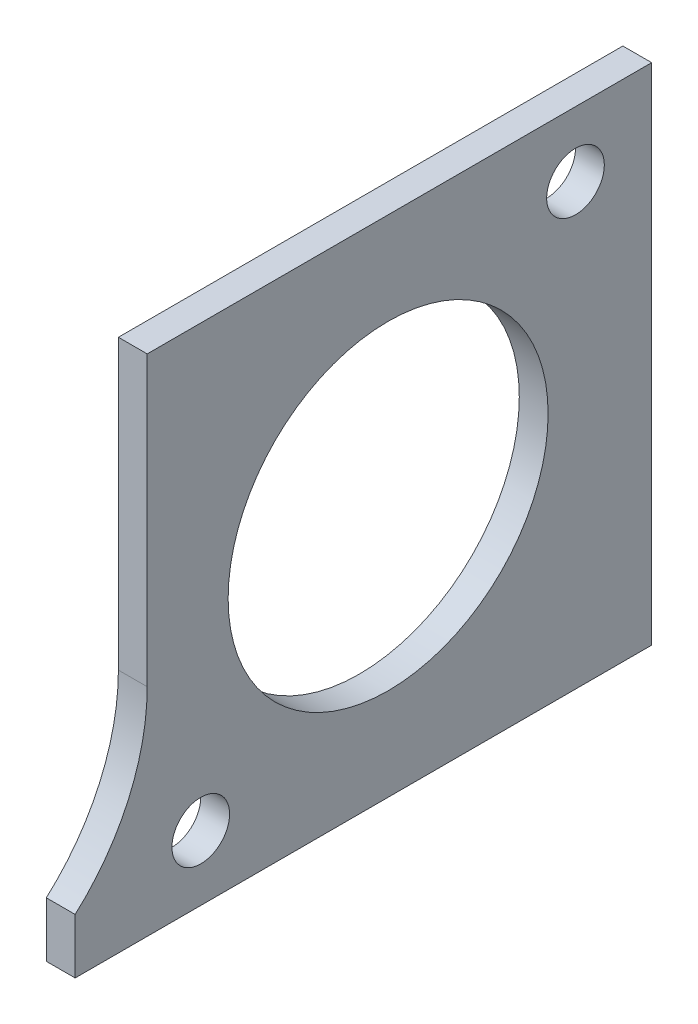
ISO-10303-21;
HEADER;
FILE_DESCRIPTION(('STEP AP214'),'2;1');
FILE_NAME('part.step','',(''),(''),'','','');
FILE_SCHEMA(('AUTOMOTIVE_DESIGN { 1 0 10303 214 1 1 1 1 }'));
ENDSEC;
DATA;
#1=APPLICATION_CONTEXT('core data for automotive mechanical design processes');
#2=APPLICATION_PROTOCOL_DEFINITION('international standard','automotive_design',2000,#1);
#3=PRODUCT_CONTEXT('',#1,'mechanical');
#4=PRODUCT('Part','Part','',(#3));
#5=PRODUCT_RELATED_PRODUCT_CATEGORY('part','',(#4));
#6=PRODUCT_DEFINITION_FORMATION('','',#4);
#7=PRODUCT_DEFINITION_CONTEXT('part definition',#1,'design');
#8=PRODUCT_DEFINITION('design','',#6,#7);
#9=PRODUCT_DEFINITION_SHAPE('','',#8);
#10=(LENGTH_UNIT() NAMED_UNIT(*) SI_UNIT(.MILLI.,.METRE.));
#11=(NAMED_UNIT(*) PLANE_ANGLE_UNIT() SI_UNIT($,.RADIAN.));
#12=(NAMED_UNIT(*) SI_UNIT($,.STERADIAN.) SOLID_ANGLE_UNIT());
#13=UNCERTAINTY_MEASURE_WITH_UNIT(LENGTH_MEASURE(1.E-05),#10,'distance_accuracy_value','');
#14=(GEOMETRIC_REPRESENTATION_CONTEXT(3) GLOBAL_UNCERTAINTY_ASSIGNED_CONTEXT((#13)) GLOBAL_UNIT_ASSIGNED_CONTEXT((#10,
#11,#12)) REPRESENTATION_CONTEXT('',''));
#15=CARTESIAN_POINT('',(0.,0.,0.));
#16=DIRECTION('',(0.,0.,1.));
#17=DIRECTION('',(1.,0.,0.));
#18=AXIS2_PLACEMENT_3D('',#15,#16,#17);
#19=CARTESIAN_POINT('',(2.,-9.34311908078087,35.0215806294578));
#20=DIRECTION('',(1.,0.,0.));
#21=DIRECTION('',(0.,0.,-1.));
#22=AXIS2_PLACEMENT_3D('',#19,#20,#21);
#23=PLANE('',#22);
#24=CARTESIAN_POINT('',(2.,-19.8431190807808,16.3071012561034));
#25=DIRECTION('',(1.,0.,0.));
#26=DIRECTION('',(0.,0.,-1.));
#27=AXIS2_PLACEMENT_3D('',#24,#25,#26);
#28=CIRCLE('',#27,2.);
#29=CARTESIAN_POINT('',(2.,-19.8431190807808,14.3071012561035));
#30=VERTEX_POINT('',#29);
#31=EDGE_CURVE('E183',#30,#30,#28,.T.);
#32=ORIENTED_EDGE('',*,*,#31,.F.);
#33=EDGE_LOOP('',(#32));
#34=FACE_BOUND('',#33,.T.);
#35=DIRECTION('',(0.,0.,1.));
#36=VECTOR('',#35,1.);
#37=CARTESIAN_POINT('',(2.,10.6568809192191,-14.9784193705422));
#38=LINE('',#37,#36);
#39=CARTESIAN_POINT('',(2.,10.6568809192191,-14.9784193705422));
#40=VERTEX_POINT('',#39);
#41=CARTESIAN_POINT('',(2.,10.6568809192191,20.0215806294578));
#42=VERTEX_POINT('',#41);
#43=EDGE_CURVE('E127',#40,#42,#38,.T.);
#44=ORIENTED_EDGE('',*,*,#43,.T.);
#45=DIRECTION('',(0.,-1.,0.));
#46=VECTOR('',#45,1.);
#47=CARTESIAN_POINT('',(2.,-9.34311908078086,20.0215806294578));
#48=LINE('',#47,#46);
#49=CARTESIAN_POINT('',(2.,-9.34311908078086,20.0215806294578));
#50=VERTEX_POINT('',#49);
#51=EDGE_CURVE('E85',#42,#50,#48,.T.);
#52=ORIENTED_EDGE('',*,*,#51,.T.);
#53=CARTESIAN_POINT('',(2.,-9.34311908078087,35.0215806294578));
#54=DIRECTION('',(-1.,0.,0.));
#55=DIRECTION('',(0.,0.,-1.));
#56=AXIS2_PLACEMENT_3D('',#53,#54,#55);
#57=CIRCLE('',#56,15.);
#58=CARTESIAN_POINT('',(2.,-20.5234589682798,25.0215806294578));
#59=VERTEX_POINT('',#58);
#60=EDGE_CURVE('E98',#50,#59,#57,.T.);
#61=ORIENTED_EDGE('',*,*,#60,.T.);
#62=DIRECTION('',(0.,-1.,0.));
#63=VECTOR('',#62,1.);
#64=CARTESIAN_POINT('',(2.,-24.3431190807809,25.0215806294578));
#65=LINE('',#64,#63);
#66=CARTESIAN_POINT('',(2.,-24.3431190807809,25.0215806294578));
#67=VERTEX_POINT('',#66);
#68=EDGE_CURVE('E92',#59,#67,#65,.T.);
#69=ORIENTED_EDGE('',*,*,#68,.T.);
#70=DIRECTION('',(0.,0.,-1.));
#71=VECTOR('',#70,1.);
#72=CARTESIAN_POINT('',(2.,-24.3431190807809,-14.9784193705422));
#73=LINE('',#72,#71);
#74=CARTESIAN_POINT('',(2.,-24.3431190807809,-14.9784193705422));
#75=VERTEX_POINT('',#74);
#76=EDGE_CURVE('E96',#67,#75,#73,.T.);
#77=ORIENTED_EDGE('',*,*,#76,.T.);
#78=DIRECTION('',(0.,1.,0.));
#79=VECTOR('',#78,1.);
#80=CARTESIAN_POINT('',(2.,-24.3431190807809,-14.9784193705422));
#81=LINE('',#80,#79);
#82=EDGE_CURVE('E48',#75,#40,#81,.T.);
#83=ORIENTED_EDGE('',*,*,#82,.T.);
#84=EDGE_LOOP('',(#44,#52,#61,#69,#77,#83));
#85=FACE_BOUND('',#84,.T.);
#86=CARTESIAN_POINT('',(2.,6.15688091921924,-9.69289874389655));
#87=DIRECTION('',(1.,0.,0.));
#88=DIRECTION('',(0.,0.,-1.));
#89=AXIS2_PLACEMENT_3D('',#86,#87,#88);
#90=CIRCLE('',#89,2.);
#91=CARTESIAN_POINT('',(2.,6.15688091921924,-11.6928987438965));
#92=VERTEX_POINT('',#91);
#93=EDGE_CURVE('E120',#92,#92,#90,.T.);
#94=ORIENTED_EDGE('',*,*,#93,.F.);
#95=EDGE_LOOP('',(#94));
#96=FACE_BOUND('',#95,.T.);
#97=CARTESIAN_POINT('',(2.,-6.84311908078076,3.30710125610346));
#98=DIRECTION('',(1.,0.,0.));
#99=DIRECTION('',(0.,0.,-1.));
#100=AXIS2_PLACEMENT_3D('',#97,#98,#99);
#101=CIRCLE('',#100,11.1);
#102=CARTESIAN_POINT('',(2.,-6.84311908078076,-7.79289874389653));
#103=VERTEX_POINT('',#102);
#104=EDGE_CURVE('E174',#103,#103,#101,.T.);
#105=ORIENTED_EDGE('',*,*,#104,.F.);
#106=EDGE_LOOP('',(#105));
#107=FACE_BOUND('',#106,.T.);
#108=ADVANCED_FACE('F31',(#34,#85,#96,#107),#23,.T.);
#109=CARTESIAN_POINT('',(0.,-9.34311908078087,35.0215806294578));
#110=DIRECTION('',(1.,0.,0.));
#111=DIRECTION('',(0.,0.,-1.));
#112=AXIS2_PLACEMENT_3D('',#109,#110,#111);
#113=PLANE('',#112);
#114=CARTESIAN_POINT('',(0.,-19.8431190807808,16.3071012561034));
#115=DIRECTION('',(1.,0.,0.));
#116=DIRECTION('',(0.,0.,-1.));
#117=AXIS2_PLACEMENT_3D('',#114,#115,#116);
#118=CIRCLE('',#117,2.);
#119=CARTESIAN_POINT('',(0.,-19.8431190807808,14.3071012561035));
#120=VERTEX_POINT('',#119);
#121=EDGE_CURVE('E180',#120,#120,#118,.T.);
#122=ORIENTED_EDGE('',*,*,#121,.T.);
#123=EDGE_LOOP('',(#122));
#124=FACE_BOUND('',#123,.T.);
#125=DIRECTION('',(0.,0.,1.));
#126=VECTOR('',#125,1.);
#127=CARTESIAN_POINT('',(0.,10.6568809192191,-14.9784193705422));
#128=LINE('',#127,#126);
#129=CARTESIAN_POINT('',(0.,10.6568809192191,-14.9784193705422));
#130=VERTEX_POINT('',#129);
#131=CARTESIAN_POINT('',(0.,10.6568809192191,20.0215806294578));
#132=VERTEX_POINT('',#131);
#133=EDGE_CURVE('E116',#130,#132,#128,.T.);
#134=ORIENTED_EDGE('',*,*,#133,.F.);
#135=DIRECTION('',(0.,1.,0.));
#136=VECTOR('',#135,1.);
#137=CARTESIAN_POINT('',(0.,-24.3431190807809,-14.9784193705422));
#138=LINE('',#137,#136);
#139=CARTESIAN_POINT('',(0.,-24.3431190807809,-14.9784193705422));
#140=VERTEX_POINT('',#139);
#141=EDGE_CURVE('E77',#140,#130,#138,.T.);
#142=ORIENTED_EDGE('',*,*,#141,.F.);
#143=DIRECTION('',(0.,0.,-1.));
#144=VECTOR('',#143,1.);
#145=CARTESIAN_POINT('',(0.,-24.3431190807809,-14.9784193705422));
#146=LINE('',#145,#144);
#147=CARTESIAN_POINT('',(0.,-24.3431190807809,25.0215806294578));
#148=VERTEX_POINT('',#147);
#149=EDGE_CURVE('E71',#148,#140,#146,.T.);
#150=ORIENTED_EDGE('',*,*,#149,.F.);
#151=DIRECTION('',(0.,-1.,0.));
#152=VECTOR('',#151,1.);
#153=CARTESIAN_POINT('',(0.,-24.3431190807809,25.0215806294578));
#154=LINE('',#153,#152);
#155=CARTESIAN_POINT('',(0.,-20.5234589682798,25.0215806294578));
#156=VERTEX_POINT('',#155);
#157=EDGE_CURVE('E106',#156,#148,#154,.T.);
#158=ORIENTED_EDGE('',*,*,#157,.F.);
#159=CARTESIAN_POINT('',(0.,-9.34311908078087,35.0215806294578));
#160=DIRECTION('',(-1.,0.,0.));
#161=DIRECTION('',(0.,0.,-1.));
#162=AXIS2_PLACEMENT_3D('',#159,#160,#161);
#163=CIRCLE('',#162,15.);
#164=CARTESIAN_POINT('',(0.,-9.34311908078086,20.0215806294578));
#165=VERTEX_POINT('',#164);
#166=EDGE_CURVE('E122',#165,#156,#163,.T.);
#167=ORIENTED_EDGE('',*,*,#166,.F.);
#168=DIRECTION('',(0.,-1.,0.));
#169=VECTOR('',#168,1.);
#170=CARTESIAN_POINT('',(0.,-9.34311908078086,20.0215806294578));
#171=LINE('',#170,#169);
#172=EDGE_CURVE('E119',#132,#165,#171,.T.);
#173=ORIENTED_EDGE('',*,*,#172,.F.);
#174=EDGE_LOOP('',(#134,#142,#150,#158,#167,#173));
#175=FACE_BOUND('',#174,.T.);
#176=CARTESIAN_POINT('',(0.,6.15688091921924,-9.69289874389655));
#177=DIRECTION('',(1.,0.,0.));
#178=DIRECTION('',(0.,0.,-1.));
#179=AXIS2_PLACEMENT_3D('',#176,#177,#178);
#180=CIRCLE('',#179,2.);
#181=CARTESIAN_POINT('',(0.,6.15688091921924,-11.6928987438965));
#182=VERTEX_POINT('',#181);
#183=EDGE_CURVE('E186',#182,#182,#180,.T.);
#184=ORIENTED_EDGE('',*,*,#183,.T.);
#185=EDGE_LOOP('',(#184));
#186=FACE_BOUND('',#185,.T.);
#187=CARTESIAN_POINT('',(0.,-6.84311908078076,3.30710125610346));
#188=DIRECTION('',(1.,0.,0.));
#189=DIRECTION('',(0.,0.,-1.));
#190=AXIS2_PLACEMENT_3D('',#187,#188,#189);
#191=CIRCLE('',#190,11.1);
#192=CARTESIAN_POINT('',(0.,-6.84311908078076,-7.79289874389653));
#193=VERTEX_POINT('',#192);
#194=EDGE_CURVE('E177',#193,#193,#191,.T.);
#195=ORIENTED_EDGE('',*,*,#194,.T.);
#196=EDGE_LOOP('',(#195));
#197=FACE_BOUND('',#196,.T.);
#198=ADVANCED_FACE('F136',(#124,#175,#186,#197),#113,.F.);
#199=CARTESIAN_POINT('',(2.,10.6568809192191,-14.9784193705422));
#200=DIRECTION('',(0.,-1.,0.));
#201=DIRECTION('',(0.,0.,-1.));
#202=AXIS2_PLACEMENT_3D('',#199,#200,#201);
#203=PLANE('',#202);
#204=ORIENTED_EDGE('',*,*,#133,.T.);
#205=DIRECTION('',(-1.,0.,0.));
#206=VECTOR('',#205,1.);
#207=CARTESIAN_POINT('',(2.,10.6568809192191,20.0215806294578));
#208=LINE('',#207,#206);
#209=EDGE_CURVE('E11',#42,#132,#208,.T.);
#210=ORIENTED_EDGE('',*,*,#209,.F.);
#211=ORIENTED_EDGE('',*,*,#43,.F.);
#212=DIRECTION('',(-1.,0.,0.));
#213=VECTOR('',#212,1.);
#214=CARTESIAN_POINT('',(2.,10.6568809192191,-14.9784193705422));
#215=LINE('',#214,#213);
#216=EDGE_CURVE('E112',#40,#130,#215,.T.);
#217=ORIENTED_EDGE('',*,*,#216,.T.);
#218=EDGE_LOOP('',(#204,#210,#211,#217));
#219=FACE_BOUND('',#218,.T.);
#220=ADVANCED_FACE('F33',(#219),#203,.F.);
#221=CARTESIAN_POINT('',(2.,-9.34311908078086,20.0215806294578));
#222=DIRECTION('',(0.,0.,-1.));
#223=DIRECTION('',(-1.,0.,0.));
#224=AXIS2_PLACEMENT_3D('',#221,#222,#223);
#225=PLANE('',#224);
#226=ORIENTED_EDGE('',*,*,#172,.T.);
#227=DIRECTION('',(-1.,0.,0.));
#228=VECTOR('',#227,1.);
#229=CARTESIAN_POINT('',(2.,-9.34311908078086,20.0215806294578));
#230=LINE('',#229,#228);
#231=EDGE_CURVE('E40',#50,#165,#230,.T.);
#232=ORIENTED_EDGE('',*,*,#231,.F.);
#233=ORIENTED_EDGE('',*,*,#51,.F.);
#234=ORIENTED_EDGE('',*,*,#209,.T.);
#235=EDGE_LOOP('',(#226,#232,#233,#234));
#236=FACE_BOUND('',#235,.T.);
#237=ADVANCED_FACE('F235',(#236),#225,.F.);
#238=CARTESIAN_POINT('',(2.,-9.34311908078087,35.0215806294578));
#239=DIRECTION('',(-1.,0.,0.));
#240=DIRECTION('',(0.,0.,1.));
#241=AXIS2_PLACEMENT_3D('',#238,#239,#240);
#242=CYLINDRICAL_SURFACE('',#241,15.);
#243=ORIENTED_EDGE('',*,*,#166,.T.);
#244=DIRECTION('',(-1.,0.,0.));
#245=VECTOR('',#244,1.);
#246=CARTESIAN_POINT('',(2.,-20.5234589682798,25.0215806294578));
#247=LINE('',#246,#245);
#248=EDGE_CURVE('E107',#59,#156,#247,.T.);
#249=ORIENTED_EDGE('',*,*,#248,.F.);
#250=ORIENTED_EDGE('',*,*,#60,.F.);
#251=ORIENTED_EDGE('',*,*,#231,.T.);
#252=EDGE_LOOP('',(#243,#249,#250,#251));
#253=FACE_BOUND('',#252,.T.);
#254=ADVANCED_FACE('F133',(#253),#242,.F.);
#255=CARTESIAN_POINT('',(2.,-24.3431190807809,25.0215806294578));
#256=DIRECTION('',(0.,0.,-1.));
#257=DIRECTION('',(-1.,0.,0.));
#258=AXIS2_PLACEMENT_3D('',#255,#256,#257);
#259=PLANE('',#258);
#260=ORIENTED_EDGE('',*,*,#157,.T.);
#261=DIRECTION('',(-1.,0.,0.));
#262=VECTOR('',#261,1.);
#263=CARTESIAN_POINT('',(2.,-24.3431190807809,25.0215806294578));
#264=LINE('',#263,#262);
#265=EDGE_CURVE('E103',#67,#148,#264,.T.);
#266=ORIENTED_EDGE('',*,*,#265,.F.);
#267=ORIENTED_EDGE('',*,*,#68,.F.);
#268=ORIENTED_EDGE('',*,*,#248,.T.);
#269=EDGE_LOOP('',(#260,#266,#267,#268));
#270=FACE_BOUND('',#269,.T.);
#271=ADVANCED_FACE('F104',(#270),#259,.F.);
#272=CARTESIAN_POINT('',(2.,-24.3431190807809,-14.9784193705422));
#273=DIRECTION('',(0.,1.,0.));
#274=DIRECTION('',(0.,0.,1.));
#275=AXIS2_PLACEMENT_3D('',#272,#273,#274);
#276=PLANE('',#275);
#277=ORIENTED_EDGE('',*,*,#149,.T.);
#278=DIRECTION('',(-1.,0.,0.));
#279=VECTOR('',#278,1.);
#280=CARTESIAN_POINT('',(2.,-24.3431190807809,-14.9784193705422));
#281=LINE('',#280,#279);
#282=EDGE_CURVE('E108',#75,#140,#281,.T.);
#283=ORIENTED_EDGE('',*,*,#282,.F.);
#284=ORIENTED_EDGE('',*,*,#76,.F.);
#285=ORIENTED_EDGE('',*,*,#265,.T.);
#286=EDGE_LOOP('',(#277,#283,#284,#285));
#287=FACE_BOUND('',#286,.T.);
#288=ADVANCED_FACE('F110',(#287),#276,.F.);
#289=CARTESIAN_POINT('',(2.,-24.3431190807809,-14.9784193705422));
#290=DIRECTION('',(0.,0.,1.));
#291=DIRECTION('',(1.,0.,0.));
#292=AXIS2_PLACEMENT_3D('',#289,#290,#291);
#293=PLANE('',#292);
#294=ORIENTED_EDGE('',*,*,#141,.T.);
#295=ORIENTED_EDGE('',*,*,#216,.F.);
#296=ORIENTED_EDGE('',*,*,#82,.F.);
#297=ORIENTED_EDGE('',*,*,#282,.T.);
#298=EDGE_LOOP('',(#294,#295,#296,#297));
#299=FACE_BOUND('',#298,.T.);
#300=ADVANCED_FACE('F141',(#299),#293,.F.);
#301=CARTESIAN_POINT('',(2.,6.15688091921924,-9.69289874389655));
#302=DIRECTION('',(-1.,0.,0.));
#303=DIRECTION('',(0.,0.,1.));
#304=AXIS2_PLACEMENT_3D('',#301,#302,#303);
#305=CYLINDRICAL_SURFACE('',#304,2.);
#306=ORIENTED_EDGE('',*,*,#93,.T.);
#307=EDGE_LOOP('',(#306));
#308=FACE_BOUND('',#307,.T.);
#309=ORIENTED_EDGE('',*,*,#183,.F.);
#310=EDGE_LOOP('',(#309));
#311=FACE_BOUND('',#310,.T.);
#312=ADVANCED_FACE('F143',(#308,#311),#305,.F.);
#313=CARTESIAN_POINT('',(2.,-19.8431190807808,16.3071012561034));
#314=DIRECTION('',(-1.,0.,0.));
#315=DIRECTION('',(0.,0.,1.));
#316=AXIS2_PLACEMENT_3D('',#313,#314,#315);
#317=CYLINDRICAL_SURFACE('',#316,2.);
#318=ORIENTED_EDGE('',*,*,#31,.T.);
#319=EDGE_LOOP('',(#318));
#320=FACE_BOUND('',#319,.T.);
#321=ORIENTED_EDGE('',*,*,#121,.F.);
#322=EDGE_LOOP('',(#321));
#323=FACE_BOUND('',#322,.T.);
#324=ADVANCED_FACE('F149',(#320,#323),#317,.F.);
#325=CARTESIAN_POINT('',(2.,-6.84311908078076,3.30710125610346));
#326=DIRECTION('',(-1.,0.,0.));
#327=DIRECTION('',(0.,0.,1.));
#328=AXIS2_PLACEMENT_3D('',#325,#326,#327);
#329=CYLINDRICAL_SURFACE('',#328,11.1);
#330=ORIENTED_EDGE('',*,*,#104,.T.);
#331=EDGE_LOOP('',(#330));
#332=FACE_BOUND('',#331,.T.);
#333=ORIENTED_EDGE('',*,*,#194,.F.);
#334=EDGE_LOOP('',(#333));
#335=FACE_BOUND('',#334,.T.);
#336=ADVANCED_FACE('F165',(#332,#335),#329,.F.);
#337=CLOSED_SHELL('',(#108,#198,#220,#237,#254,#271,#288,#300,#312,#324,#336));
#338=MANIFOLD_SOLID_BREP('B2',#337);
#339=ADVANCED_BREP_SHAPE_REPRESENTATION('',(#18,#338),#14);
#340=SHAPE_DEFINITION_REPRESENTATION(#9,#339);
ENDSEC;
END-ISO-10303-21;
